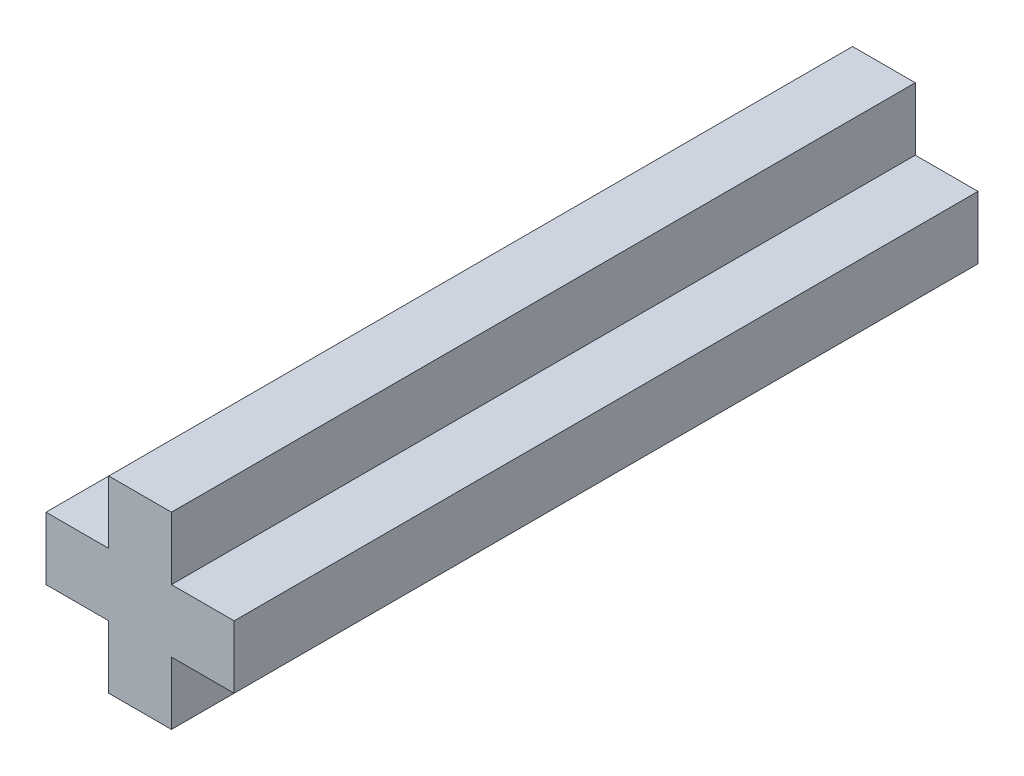
ISO-10303-21;
HEADER;
FILE_DESCRIPTION(('STEP AP214'),'2;1');
FILE_NAME('part.step','',(''),(''),'','','');
FILE_SCHEMA(('AUTOMOTIVE_DESIGN { 1 0 10303 214 1 1 1 1 }'));
ENDSEC;
DATA;
#1=APPLICATION_CONTEXT('core data for automotive mechanical design processes');
#2=APPLICATION_PROTOCOL_DEFINITION('international standard','automotive_design',2000,#1);
#3=PRODUCT_CONTEXT('',#1,'mechanical');
#4=PRODUCT('Part','Part','',(#3));
#5=PRODUCT_RELATED_PRODUCT_CATEGORY('part','',(#4));
#6=PRODUCT_DEFINITION_FORMATION('','',#4);
#7=PRODUCT_DEFINITION_CONTEXT('part definition',#1,'design');
#8=PRODUCT_DEFINITION('design','',#6,#7);
#9=PRODUCT_DEFINITION_SHAPE('','',#8);
#10=(LENGTH_UNIT() NAMED_UNIT(*) SI_UNIT(.MILLI.,.METRE.));
#11=(NAMED_UNIT(*) PLANE_ANGLE_UNIT() SI_UNIT($,.RADIAN.));
#12=(NAMED_UNIT(*) SI_UNIT($,.STERADIAN.) SOLID_ANGLE_UNIT());
#13=UNCERTAINTY_MEASURE_WITH_UNIT(LENGTH_MEASURE(1.E-05),#10,'distance_accuracy_value','');
#14=(GEOMETRIC_REPRESENTATION_CONTEXT(3) GLOBAL_UNCERTAINTY_ASSIGNED_CONTEXT((#13)) GLOBAL_UNIT_ASSIGNED_CONTEXT((#10,
#11,#12)) REPRESENTATION_CONTEXT('',''));
#15=CARTESIAN_POINT('',(0.,0.,0.));
#16=DIRECTION('',(0.,0.,1.));
#17=DIRECTION('',(1.,0.,0.));
#18=AXIS2_PLACEMENT_3D('',#15,#16,#17);
#19=CARTESIAN_POINT('',(-1.26491106406735,-1.26491106406735,30.));
#20=DIRECTION('',(0.,1.,0.));
#21=DIRECTION('',(0.,0.,1.));
#22=AXIS2_PLACEMENT_3D('',#19,#20,#21);
#23=PLANE('',#22);
#24=DIRECTION('',(1.,0.,0.));
#25=VECTOR('',#24,1.);
#26=CARTESIAN_POINT('',(-1.26491106406735,-1.26491106406735,0.));
#27=LINE('',#26,#25);
#28=CARTESIAN_POINT('',(-3.79473319220205,-1.26491106406735,0.));
#29=VERTEX_POINT('',#28);
#30=CARTESIAN_POINT('',(-1.26491106406735,-1.26491106406735,0.));
#31=VERTEX_POINT('',#30);
#32=EDGE_CURVE('E164',#29,#31,#27,.T.);
#33=ORIENTED_EDGE('',*,*,#32,.T.);
#34=DIRECTION('',(0.,0.,-1.));
#35=VECTOR('',#34,1.);
#36=CARTESIAN_POINT('',(-1.26491106406735,-1.26491106406735,30.));
#37=LINE('',#36,#35);
#38=CARTESIAN_POINT('',(-1.26491106406735,-1.26491106406735,30.));
#39=VERTEX_POINT('',#38);
#40=EDGE_CURVE('E11',#39,#31,#37,.T.);
#41=ORIENTED_EDGE('',*,*,#40,.F.);
#42=DIRECTION('',(1.,0.,0.));
#43=VECTOR('',#42,1.);
#44=CARTESIAN_POINT('',(-1.26491106406735,-1.26491106406735,30.));
#45=LINE('',#44,#43);
#46=CARTESIAN_POINT('',(-3.79473319220205,-1.26491106406735,30.));
#47=VERTEX_POINT('',#46);
#48=EDGE_CURVE('E198',#47,#39,#45,.T.);
#49=ORIENTED_EDGE('',*,*,#48,.F.);
#50=DIRECTION('',(0.,0.,-1.));
#51=VECTOR('',#50,1.);
#52=CARTESIAN_POINT('',(-3.79473319220205,-1.26491106406735,30.));
#53=LINE('',#52,#51);
#54=EDGE_CURVE('E160',#47,#29,#53,.T.);
#55=ORIENTED_EDGE('',*,*,#54,.T.);
#56=EDGE_LOOP('',(#33,#41,#49,#55));
#57=FACE_BOUND('',#56,.T.);
#58=ADVANCED_FACE('F39',(#57),#23,.F.);
#59=CARTESIAN_POINT('',(-1.26491106406735,-3.79473319220206,30.));
#60=DIRECTION('',(1.,0.,0.));
#61=DIRECTION('',(0.,0.,-1.));
#62=AXIS2_PLACEMENT_3D('',#59,#60,#61);
#63=PLANE('',#62);
#64=DIRECTION('',(0.,-1.,0.));
#65=VECTOR('',#64,1.);
#66=CARTESIAN_POINT('',(-1.26491106406735,-3.79473319220206,0.));
#67=LINE('',#66,#65);
#68=CARTESIAN_POINT('',(-1.26491106406735,-3.79473319220206,0.));
#69=VERTEX_POINT('',#68);
#70=EDGE_CURVE('E168',#31,#69,#67,.T.);
#71=ORIENTED_EDGE('',*,*,#70,.T.);
#72=DIRECTION('',(0.,0.,-1.));
#73=VECTOR('',#72,1.);
#74=CARTESIAN_POINT('',(-1.26491106406735,-3.79473319220206,30.));
#75=LINE('',#74,#73);
#76=CARTESIAN_POINT('',(-1.26491106406735,-3.79473319220206,30.));
#77=VERTEX_POINT('',#76);
#78=EDGE_CURVE('E48',#77,#69,#75,.T.);
#79=ORIENTED_EDGE('',*,*,#78,.F.);
#80=DIRECTION('',(0.,-1.,0.));
#81=VECTOR('',#80,1.);
#82=CARTESIAN_POINT('',(-1.26491106406735,-3.79473319220206,30.));
#83=LINE('',#82,#81);
#84=EDGE_CURVE('E111',#39,#77,#83,.T.);
#85=ORIENTED_EDGE('',*,*,#84,.F.);
#86=ORIENTED_EDGE('',*,*,#40,.T.);
#87=EDGE_LOOP('',(#71,#79,#85,#86));
#88=FACE_BOUND('',#87,.T.);
#89=ADVANCED_FACE('F292',(#88),#63,.F.);
#90=CARTESIAN_POINT('',(1.26491106406735,-3.79473319220206,30.));
#91=DIRECTION('',(0.,1.,0.));
#92=DIRECTION('',(0.,0.,1.));
#93=AXIS2_PLACEMENT_3D('',#90,#91,#92);
#94=PLANE('',#93);
#95=DIRECTION('',(1.,0.,0.));
#96=VECTOR('',#95,1.);
#97=CARTESIAN_POINT('',(1.26491106406735,-3.79473319220206,0.));
#98=LINE('',#97,#96);
#99=CARTESIAN_POINT('',(1.26491106406735,-3.79473319220206,0.));
#100=VERTEX_POINT('',#99);
#101=EDGE_CURVE('E171',#69,#100,#98,.T.);
#102=ORIENTED_EDGE('',*,*,#101,.T.);
#103=DIRECTION('',(0.,0.,-1.));
#104=VECTOR('',#103,1.);
#105=CARTESIAN_POINT('',(1.26491106406735,-3.79473319220206,30.));
#106=LINE('',#105,#104);
#107=CARTESIAN_POINT('',(1.26491106406735,-3.79473319220206,30.));
#108=VERTEX_POINT('',#107);
#109=EDGE_CURVE('E225',#108,#100,#106,.T.);
#110=ORIENTED_EDGE('',*,*,#109,.F.);
#111=DIRECTION('',(1.,0.,0.));
#112=VECTOR('',#111,1.);
#113=CARTESIAN_POINT('',(1.26491106406735,-3.79473319220206,30.));
#114=LINE('',#113,#112);
#115=EDGE_CURVE('E235',#77,#108,#114,.T.);
#116=ORIENTED_EDGE('',*,*,#115,.F.);
#117=ORIENTED_EDGE('',*,*,#78,.T.);
#118=EDGE_LOOP('',(#102,#110,#116,#117));
#119=FACE_BOUND('',#118,.T.);
#120=ADVANCED_FACE('F233',(#119),#94,.F.);
#121=CARTESIAN_POINT('',(1.26491106406735,-1.26491106406735,30.));
#122=DIRECTION('',(-1.,0.,0.));
#123=DIRECTION('',(0.,0.,1.));
#124=AXIS2_PLACEMENT_3D('',#121,#122,#123);
#125=PLANE('',#124);
#126=DIRECTION('',(0.,1.,0.));
#127=VECTOR('',#126,1.);
#128=CARTESIAN_POINT('',(1.26491106406735,-1.26491106406735,0.));
#129=LINE('',#128,#127);
#130=CARTESIAN_POINT('',(1.26491106406735,-1.26491106406735,0.));
#131=VERTEX_POINT('',#130);
#132=EDGE_CURVE('E174',#100,#131,#129,.T.);
#133=ORIENTED_EDGE('',*,*,#132,.T.);
#134=DIRECTION('',(0.,0.,-1.));
#135=VECTOR('',#134,1.);
#136=CARTESIAN_POINT('',(1.26491106406735,-1.26491106406735,30.));
#137=LINE('',#136,#135);
#138=CARTESIAN_POINT('',(1.26491106406735,-1.26491106406735,30.));
#139=VERTEX_POINT('',#138);
#140=EDGE_CURVE('E221',#139,#131,#137,.T.);
#141=ORIENTED_EDGE('',*,*,#140,.F.);
#142=DIRECTION('',(0.,1.,0.));
#143=VECTOR('',#142,1.);
#144=CARTESIAN_POINT('',(1.26491106406735,-1.26491106406735,30.));
#145=LINE('',#144,#143);
#146=EDGE_CURVE('E254',#108,#139,#145,.T.);
#147=ORIENTED_EDGE('',*,*,#146,.F.);
#148=ORIENTED_EDGE('',*,*,#109,.T.);
#149=EDGE_LOOP('',(#133,#141,#147,#148));
#150=FACE_BOUND('',#149,.T.);
#151=ADVANCED_FACE('F244',(#150),#125,.F.);
#152=CARTESIAN_POINT('',(3.79473319220205,-1.26491106406735,30.));
#153=DIRECTION('',(0.,1.,0.));
#154=DIRECTION('',(0.,0.,1.));
#155=AXIS2_PLACEMENT_3D('',#152,#153,#154);
#156=PLANE('',#155);
#157=DIRECTION('',(1.,0.,0.));
#158=VECTOR('',#157,1.);
#159=CARTESIAN_POINT('',(3.79473319220205,-1.26491106406735,0.));
#160=LINE('',#159,#158);
#161=CARTESIAN_POINT('',(3.79473319220205,-1.26491106406735,0.));
#162=VERTEX_POINT('',#161);
#163=EDGE_CURVE('E177',#131,#162,#160,.T.);
#164=ORIENTED_EDGE('',*,*,#163,.T.);
#165=DIRECTION('',(0.,0.,-1.));
#166=VECTOR('',#165,1.);
#167=CARTESIAN_POINT('',(3.79473319220205,-1.26491106406735,30.));
#168=LINE('',#167,#166);
#169=CARTESIAN_POINT('',(3.79473319220205,-1.26491106406735,30.));
#170=VERTEX_POINT('',#169);
#171=EDGE_CURVE('E217',#170,#162,#168,.T.);
#172=ORIENTED_EDGE('',*,*,#171,.F.);
#173=DIRECTION('',(1.,0.,0.));
#174=VECTOR('',#173,1.);
#175=CARTESIAN_POINT('',(3.79473319220205,-1.26491106406735,30.));
#176=LINE('',#175,#174);
#177=EDGE_CURVE('E250',#139,#170,#176,.T.);
#178=ORIENTED_EDGE('',*,*,#177,.F.);
#179=ORIENTED_EDGE('',*,*,#140,.T.);
#180=EDGE_LOOP('',(#164,#172,#178,#179));
#181=FACE_BOUND('',#180,.T.);
#182=ADVANCED_FACE('F248',(#181),#156,.F.);
#183=CARTESIAN_POINT('',(3.79473319220205,1.26491106406735,30.));
#184=DIRECTION('',(-1.,0.,0.));
#185=DIRECTION('',(0.,0.,1.));
#186=AXIS2_PLACEMENT_3D('',#183,#184,#185);
#187=PLANE('',#186);
#188=DIRECTION('',(0.,1.,0.));
#189=VECTOR('',#188,1.);
#190=CARTESIAN_POINT('',(3.79473319220205,1.26491106406735,0.));
#191=LINE('',#190,#189);
#192=CARTESIAN_POINT('',(3.79473319220205,1.26491106406735,0.));
#193=VERTEX_POINT('',#192);
#194=EDGE_CURVE('E180',#162,#193,#191,.T.);
#195=ORIENTED_EDGE('',*,*,#194,.T.);
#196=DIRECTION('',(0.,0.,-1.));
#197=VECTOR('',#196,1.);
#198=CARTESIAN_POINT('',(3.79473319220205,1.26491106406735,30.));
#199=LINE('',#198,#197);
#200=CARTESIAN_POINT('',(3.79473319220205,1.26491106406735,30.));
#201=VERTEX_POINT('',#200);
#202=EDGE_CURVE('E213',#201,#193,#199,.T.);
#203=ORIENTED_EDGE('',*,*,#202,.F.);
#204=DIRECTION('',(0.,1.,0.));
#205=VECTOR('',#204,1.);
#206=CARTESIAN_POINT('',(3.79473319220205,1.26491106406735,30.));
#207=LINE('',#206,#205);
#208=EDGE_CURVE('E253',#170,#201,#207,.T.);
#209=ORIENTED_EDGE('',*,*,#208,.F.);
#210=ORIENTED_EDGE('',*,*,#171,.T.);
#211=EDGE_LOOP('',(#195,#203,#209,#210));
#212=FACE_BOUND('',#211,.T.);
#213=ADVANCED_FACE('F305',(#212),#187,.F.);
#214=CARTESIAN_POINT('',(1.26491106406735,1.26491106406735,30.));
#215=DIRECTION('',(0.,-1.,0.));
#216=DIRECTION('',(0.,0.,-1.));
#217=AXIS2_PLACEMENT_3D('',#214,#215,#216);
#218=PLANE('',#217);
#219=DIRECTION('',(-1.,0.,0.));
#220=VECTOR('',#219,1.);
#221=CARTESIAN_POINT('',(1.26491106406735,1.26491106406735,0.));
#222=LINE('',#221,#220);
#223=CARTESIAN_POINT('',(1.26491106406735,1.26491106406735,0.));
#224=VERTEX_POINT('',#223);
#225=EDGE_CURVE('E183',#193,#224,#222,.T.);
#226=ORIENTED_EDGE('',*,*,#225,.T.);
#227=DIRECTION('',(0.,0.,-1.));
#228=VECTOR('',#227,1.);
#229=CARTESIAN_POINT('',(1.26491106406735,1.26491106406735,30.));
#230=LINE('',#229,#228);
#231=CARTESIAN_POINT('',(1.26491106406735,1.26491106406735,30.));
#232=VERTEX_POINT('',#231);
#233=EDGE_CURVE('E209',#232,#224,#230,.T.);
#234=ORIENTED_EDGE('',*,*,#233,.F.);
#235=DIRECTION('',(-1.,0.,0.));
#236=VECTOR('',#235,1.);
#237=CARTESIAN_POINT('',(1.26491106406735,1.26491106406735,30.));
#238=LINE('',#237,#236);
#239=EDGE_CURVE('E258',#201,#232,#238,.T.);
#240=ORIENTED_EDGE('',*,*,#239,.F.);
#241=ORIENTED_EDGE('',*,*,#202,.T.);
#242=EDGE_LOOP('',(#226,#234,#240,#241));
#243=FACE_BOUND('',#242,.T.);
#244=ADVANCED_FACE('F308',(#243),#218,.F.);
#245=CARTESIAN_POINT('',(1.26491106406735,3.79473319220206,30.));
#246=DIRECTION('',(-1.,0.,0.));
#247=DIRECTION('',(0.,0.,1.));
#248=AXIS2_PLACEMENT_3D('',#245,#246,#247);
#249=PLANE('',#248);
#250=DIRECTION('',(0.,1.,0.));
#251=VECTOR('',#250,1.);
#252=CARTESIAN_POINT('',(1.26491106406735,3.79473319220206,0.));
#253=LINE('',#252,#251);
#254=CARTESIAN_POINT('',(1.26491106406735,3.79473319220206,0.));
#255=VERTEX_POINT('',#254);
#256=EDGE_CURVE('E186',#224,#255,#253,.T.);
#257=ORIENTED_EDGE('',*,*,#256,.T.);
#258=DIRECTION('',(0.,0.,-1.));
#259=VECTOR('',#258,1.);
#260=CARTESIAN_POINT('',(1.26491106406735,3.79473319220206,30.));
#261=LINE('',#260,#259);
#262=CARTESIAN_POINT('',(1.26491106406735,3.79473319220206,30.));
#263=VERTEX_POINT('',#262);
#264=EDGE_CURVE('E205',#263,#255,#261,.T.);
#265=ORIENTED_EDGE('',*,*,#264,.F.);
#266=DIRECTION('',(0.,1.,0.));
#267=VECTOR('',#266,1.);
#268=CARTESIAN_POINT('',(1.26491106406735,3.79473319220206,30.));
#269=LINE('',#268,#267);
#270=EDGE_CURVE('E265',#232,#263,#269,.T.);
#271=ORIENTED_EDGE('',*,*,#270,.F.);
#272=ORIENTED_EDGE('',*,*,#233,.T.);
#273=EDGE_LOOP('',(#257,#265,#271,#272));
#274=FACE_BOUND('',#273,.T.);
#275=ADVANCED_FACE('F273',(#274),#249,.F.);
#276=CARTESIAN_POINT('',(-1.26491106406735,3.79473319220206,30.));
#277=DIRECTION('',(0.,-1.,0.));
#278=DIRECTION('',(0.,0.,-1.));
#279=AXIS2_PLACEMENT_3D('',#276,#277,#278);
#280=PLANE('',#279);
#281=DIRECTION('',(-1.,0.,0.));
#282=VECTOR('',#281,1.);
#283=CARTESIAN_POINT('',(-1.26491106406735,3.79473319220206,0.));
#284=LINE('',#283,#282);
#285=CARTESIAN_POINT('',(-1.26491106406735,3.79473319220206,0.));
#286=VERTEX_POINT('',#285);
#287=EDGE_CURVE('E189',#255,#286,#284,.T.);
#288=ORIENTED_EDGE('',*,*,#287,.T.);
#289=DIRECTION('',(0.,0.,-1.));
#290=VECTOR('',#289,1.);
#291=CARTESIAN_POINT('',(-1.26491106406735,3.79473319220206,30.));
#292=LINE('',#291,#290);
#293=CARTESIAN_POINT('',(-1.26491106406735,3.79473319220206,30.));
#294=VERTEX_POINT('',#293);
#295=EDGE_CURVE('E153',#294,#286,#292,.T.);
#296=ORIENTED_EDGE('',*,*,#295,.F.);
#297=DIRECTION('',(-1.,0.,0.));
#298=VECTOR('',#297,1.);
#299=CARTESIAN_POINT('',(-1.26491106406735,3.79473319220206,30.));
#300=LINE('',#299,#298);
#301=EDGE_CURVE('E142',#263,#294,#300,.T.);
#302=ORIENTED_EDGE('',*,*,#301,.F.);
#303=ORIENTED_EDGE('',*,*,#264,.T.);
#304=EDGE_LOOP('',(#288,#296,#302,#303));
#305=FACE_BOUND('',#304,.T.);
#306=ADVANCED_FACE('F277',(#305),#280,.F.);
#307=CARTESIAN_POINT('',(-1.26491106406735,1.26491106406735,30.));
#308=DIRECTION('',(1.,0.,0.));
#309=DIRECTION('',(0.,0.,-1.));
#310=AXIS2_PLACEMENT_3D('',#307,#308,#309);
#311=PLANE('',#310);
#312=DIRECTION('',(0.,-1.,0.));
#313=VECTOR('',#312,1.);
#314=CARTESIAN_POINT('',(-1.26491106406735,1.26491106406735,0.));
#315=LINE('',#314,#313);
#316=CARTESIAN_POINT('',(-1.26491106406735,1.26491106406735,0.));
#317=VERTEX_POINT('',#316);
#318=EDGE_CURVE('E151',#286,#317,#315,.T.);
#319=ORIENTED_EDGE('',*,*,#318,.T.);
#320=DIRECTION('',(0.,0.,-1.));
#321=VECTOR('',#320,1.);
#322=CARTESIAN_POINT('',(-1.26491106406735,1.26491106406735,30.));
#323=LINE('',#322,#321);
#324=CARTESIAN_POINT('',(-1.26491106406735,1.26491106406735,30.));
#325=VERTEX_POINT('',#324);
#326=EDGE_CURVE('E148',#325,#317,#323,.T.);
#327=ORIENTED_EDGE('',*,*,#326,.F.);
#328=DIRECTION('',(0.,-1.,0.));
#329=VECTOR('',#328,1.);
#330=CARTESIAN_POINT('',(-1.26491106406735,1.26491106406735,30.));
#331=LINE('',#330,#329);
#332=EDGE_CURVE('E136',#294,#325,#331,.T.);
#333=ORIENTED_EDGE('',*,*,#332,.F.);
#334=ORIENTED_EDGE('',*,*,#295,.T.);
#335=EDGE_LOOP('',(#319,#327,#333,#334));
#336=FACE_BOUND('',#335,.T.);
#337=ADVANCED_FACE('F149',(#336),#311,.F.);
#338=CARTESIAN_POINT('',(-3.79473319220205,1.26491106406735,30.));
#339=DIRECTION('',(0.,-1.,0.));
#340=DIRECTION('',(0.,0.,-1.));
#341=AXIS2_PLACEMENT_3D('',#338,#339,#340);
#342=PLANE('',#341);
#343=DIRECTION('',(-1.,0.,0.));
#344=VECTOR('',#343,1.);
#345=CARTESIAN_POINT('',(-3.79473319220205,1.26491106406735,0.));
#346=LINE('',#345,#344);
#347=CARTESIAN_POINT('',(-3.79473319220205,1.26491106406735,0.));
#348=VERTEX_POINT('',#347);
#349=EDGE_CURVE('E97',#317,#348,#346,.T.);
#350=ORIENTED_EDGE('',*,*,#349,.T.);
#351=DIRECTION('',(0.,0.,-1.));
#352=VECTOR('',#351,1.);
#353=CARTESIAN_POINT('',(-3.79473319220205,1.26491106406735,30.));
#354=LINE('',#353,#352);
#355=CARTESIAN_POINT('',(-3.79473319220205,1.26491106406735,30.));
#356=VERTEX_POINT('',#355);
#357=EDGE_CURVE('E154',#356,#348,#354,.T.);
#358=ORIENTED_EDGE('',*,*,#357,.F.);
#359=DIRECTION('',(-1.,0.,0.));
#360=VECTOR('',#359,1.);
#361=CARTESIAN_POINT('',(-3.79473319220205,1.26491106406735,30.));
#362=LINE('',#361,#360);
#363=EDGE_CURVE('E140',#325,#356,#362,.T.);
#364=ORIENTED_EDGE('',*,*,#363,.F.);
#365=ORIENTED_EDGE('',*,*,#326,.T.);
#366=EDGE_LOOP('',(#350,#358,#364,#365));
#367=FACE_BOUND('',#366,.T.);
#368=ADVANCED_FACE('F156',(#367),#342,.F.);
#369=CARTESIAN_POINT('',(-3.79473319220205,1.26491106406735,30.));
#370=DIRECTION('',(1.,0.,0.));
#371=DIRECTION('',(0.,0.,-1.));
#372=AXIS2_PLACEMENT_3D('',#369,#370,#371);
#373=PLANE('',#372);
#374=DIRECTION('',(0.,-1.,0.));
#375=VECTOR('',#374,1.);
#376=CARTESIAN_POINT('',(-3.79473319220205,1.26491106406735,0.));
#377=LINE('',#376,#375);
#378=EDGE_CURVE('E103',#348,#29,#377,.T.);
#379=ORIENTED_EDGE('',*,*,#378,.T.);
#380=ORIENTED_EDGE('',*,*,#54,.F.);
#381=DIRECTION('',(0.,-1.,0.));
#382=VECTOR('',#381,1.);
#383=CARTESIAN_POINT('',(-3.79473319220205,1.26491106406735,30.));
#384=LINE('',#383,#382);
#385=EDGE_CURVE('E56',#356,#47,#384,.T.);
#386=ORIENTED_EDGE('',*,*,#385,.F.);
#387=ORIENTED_EDGE('',*,*,#357,.T.);
#388=EDGE_LOOP('',(#379,#380,#386,#387));
#389=FACE_BOUND('',#388,.T.);
#390=ADVANCED_FACE('F281',(#389),#373,.F.);
#391=CARTESIAN_POINT('',(0.,0.,30.));
#392=DIRECTION('',(0.,0.,1.));
#393=DIRECTION('',(1.,0.,0.));
#394=AXIS2_PLACEMENT_3D('',#391,#392,#393);
#395=PLANE('',#394);
#396=ORIENTED_EDGE('',*,*,#48,.T.);
#397=ORIENTED_EDGE('',*,*,#84,.T.);
#398=ORIENTED_EDGE('',*,*,#115,.T.);
#399=ORIENTED_EDGE('',*,*,#146,.T.);
#400=ORIENTED_EDGE('',*,*,#177,.T.);
#401=ORIENTED_EDGE('',*,*,#208,.T.);
#402=ORIENTED_EDGE('',*,*,#239,.T.);
#403=ORIENTED_EDGE('',*,*,#270,.T.);
#404=ORIENTED_EDGE('',*,*,#301,.T.);
#405=ORIENTED_EDGE('',*,*,#332,.T.);
#406=ORIENTED_EDGE('',*,*,#363,.T.);
#407=ORIENTED_EDGE('',*,*,#385,.T.);
#408=EDGE_LOOP('',(#396,#397,#398,#399,#400,#401,#402,#403,#404,#405,#406,#407));
#409=FACE_BOUND('',#408,.T.);
#410=ADVANCED_FACE('F138',(#409),#395,.T.);
#411=CARTESIAN_POINT('',(0.,0.,0.));
#412=DIRECTION('',(0.,0.,1.));
#413=DIRECTION('',(1.,0.,0.));
#414=AXIS2_PLACEMENT_3D('',#411,#412,#413);
#415=PLANE('',#414);
#416=ORIENTED_EDGE('',*,*,#32,.F.);
#417=ORIENTED_EDGE('',*,*,#378,.F.);
#418=ORIENTED_EDGE('',*,*,#349,.F.);
#419=ORIENTED_EDGE('',*,*,#318,.F.);
#420=ORIENTED_EDGE('',*,*,#287,.F.);
#421=ORIENTED_EDGE('',*,*,#256,.F.);
#422=ORIENTED_EDGE('',*,*,#225,.F.);
#423=ORIENTED_EDGE('',*,*,#194,.F.);
#424=ORIENTED_EDGE('',*,*,#163,.F.);
#425=ORIENTED_EDGE('',*,*,#132,.F.);
#426=ORIENTED_EDGE('',*,*,#101,.F.);
#427=ORIENTED_EDGE('',*,*,#70,.F.);
#428=EDGE_LOOP('',(#416,#417,#418,#419,#420,#421,#422,#423,#424,#425,#426,#427));
#429=FACE_BOUND('',#428,.T.);
#430=ADVANCED_FACE('F239',(#429),#415,.F.);
#431=CLOSED_SHELL('',(#58,#89,#120,#151,#182,#213,#244,#275,#306,#337,#368,#390,#410,#430));
#432=MANIFOLD_SOLID_BREP('B2',#431);
#433=ADVANCED_BREP_SHAPE_REPRESENTATION('',(#18,#432),#14);
#434=SHAPE_DEFINITION_REPRESENTATION(#9,#433);
ENDSEC;
END-ISO-10303-21;
